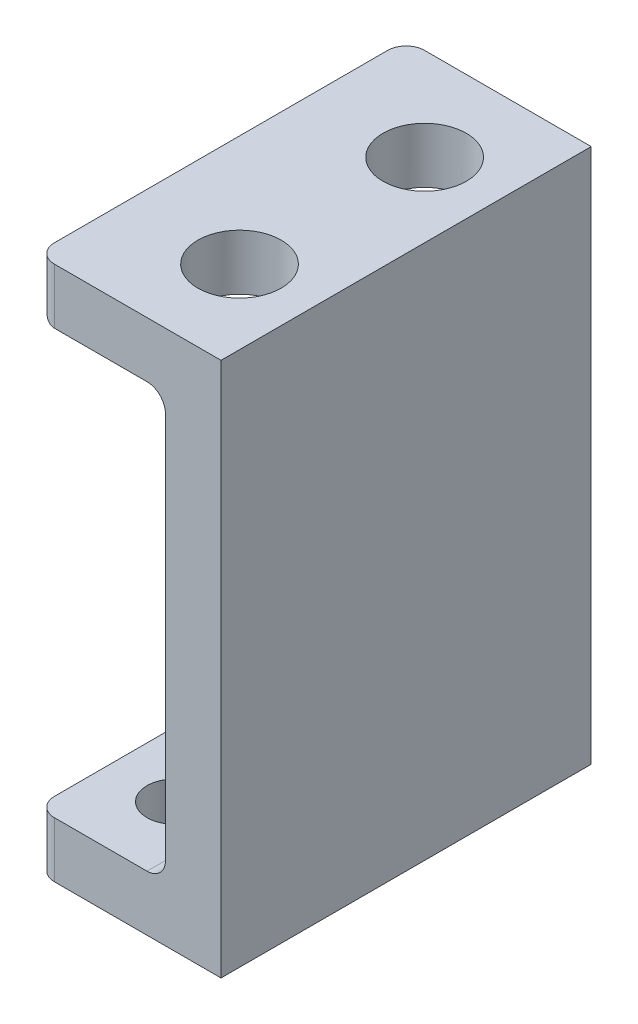
ISO-10303-21;
HEADER;
FILE_DESCRIPTION(('STEP AP214'),'2;1');
FILE_NAME('part.step','',(''),(''),'','','');
FILE_SCHEMA(('AUTOMOTIVE_DESIGN { 1 0 10303 214 1 1 1 1 }'));
ENDSEC;
DATA;
#1=APPLICATION_CONTEXT('core data for automotive mechanical design processes');
#2=APPLICATION_PROTOCOL_DEFINITION('international standard','automotive_design',2000,#1);
#3=PRODUCT_CONTEXT('',#1,'mechanical');
#4=PRODUCT('Part','Part','',(#3));
#5=PRODUCT_RELATED_PRODUCT_CATEGORY('part','',(#4));
#6=PRODUCT_DEFINITION_FORMATION('','',#4);
#7=PRODUCT_DEFINITION_CONTEXT('part definition',#1,'design');
#8=PRODUCT_DEFINITION('design','',#6,#7);
#9=PRODUCT_DEFINITION_SHAPE('','',#8);
#10=(LENGTH_UNIT() NAMED_UNIT(*) SI_UNIT(.MILLI.,.METRE.));
#11=(NAMED_UNIT(*) PLANE_ANGLE_UNIT() SI_UNIT($,.RADIAN.));
#12=(NAMED_UNIT(*) SI_UNIT($,.STERADIAN.) SOLID_ANGLE_UNIT());
#13=UNCERTAINTY_MEASURE_WITH_UNIT(LENGTH_MEASURE(1.E-05),#10,'distance_accuracy_value','');
#14=(GEOMETRIC_REPRESENTATION_CONTEXT(3) GLOBAL_UNCERTAINTY_ASSIGNED_CONTEXT((#13)) GLOBAL_UNIT_ASSIGNED_CONTEXT((#10,
#11,#12)) REPRESENTATION_CONTEXT('',''));
#15=CARTESIAN_POINT('',(0.,0.,0.));
#16=DIRECTION('',(0.,0.,1.));
#17=DIRECTION('',(1.,0.,0.));
#18=AXIS2_PLACEMENT_3D('',#15,#16,#17);
#19=CARTESIAN_POINT('',(-7.,-10.5818997294169,20.));
#20=DIRECTION('',(0.,-1.,0.));
#21=DIRECTION('',(0.,0.,-1.));
#22=AXIS2_PLACEMENT_3D('',#19,#20,#21);
#23=PLANE('',#22);
#24=CARTESIAN_POINT('',(-3.5,-10.5818997294169,4.));
#25=DIRECTION('',(0.,1.,0.));
#26=DIRECTION('',(0.,0.,1.));
#27=AXIS2_PLACEMENT_3D('',#24,#25,#26);
#28=CIRCLE('',#27,1.5);
#29=CARTESIAN_POINT('',(-3.5,-10.5818997294169,5.5));
#30=VERTEX_POINT('',#29);
#31=EDGE_CURVE('E277',#30,#30,#28,.T.);
#32=ORIENTED_EDGE('',*,*,#31,.F.);
#33=EDGE_LOOP('',(#32));
#34=FACE_BOUND('',#33,.T.);
#35=CARTESIAN_POINT('',(-3.5,-10.5818997294169,10.));
#36=DIRECTION('',(0.,1.,0.));
#37=DIRECTION('',(0.,0.,1.));
#38=AXIS2_PLACEMENT_3D('',#35,#36,#37);
#39=CIRCLE('',#38,1.5);
#40=CARTESIAN_POINT('',(-3.5,-10.5818997294169,11.5));
#41=VERTEX_POINT('',#40);
#42=EDGE_CURVE('E667',#41,#41,#39,.T.);
#43=ORIENTED_EDGE('',*,*,#42,.F.);
#44=EDGE_LOOP('',(#43));
#45=FACE_BOUND('',#44,.T.);
#46=CARTESIAN_POINT('',(-3.5,-10.5818997294169,16.));
#47=DIRECTION('',(0.,1.,0.));
#48=DIRECTION('',(0.,0.,1.));
#49=AXIS2_PLACEMENT_3D('',#46,#47,#48);
#50=CIRCLE('',#49,1.5);
#51=CARTESIAN_POINT('',(-3.5,-10.5818997294169,17.5));
#52=VERTEX_POINT('',#51);
#53=EDGE_CURVE('E331',#52,#52,#50,.T.);
#54=ORIENTED_EDGE('',*,*,#53,.F.);
#55=EDGE_LOOP('',(#54));
#56=FACE_BOUND('',#55,.T.);
#57=DIRECTION('',(-1.,0.,0.));
#58=VECTOR('',#57,1.);
#59=CARTESIAN_POINT('',(-7.,-10.5818997294169,20.));
#60=LINE('',#59,#58);
#61=CARTESIAN_POINT('',(-1.,-10.5818997294169,20.));
#62=VERTEX_POINT('',#61);
#63=CARTESIAN_POINT('',(-6.,-10.5818997294169,20.));
#64=VERTEX_POINT('',#63);
#65=EDGE_CURVE('E221',#62,#64,#60,.T.);
#66=ORIENTED_EDGE('',*,*,#65,.F.);
#67=DIRECTION('',(0.,0.,-1.));
#68=VECTOR('',#67,1.);
#69=CARTESIAN_POINT('',(-1.,-10.5818997294169,0.));
#70=LINE('',#69,#68);
#71=CARTESIAN_POINT('',(-1.,-10.5818997294169,0.));
#72=VERTEX_POINT('',#71);
#73=EDGE_CURVE('E305',#62,#72,#70,.T.);
#74=ORIENTED_EDGE('',*,*,#73,.T.);
#75=DIRECTION('',(-1.,0.,0.));
#76=VECTOR('',#75,1.);
#77=CARTESIAN_POINT('',(-7.,-10.5818997294169,0.));
#78=LINE('',#77,#76);
#79=CARTESIAN_POINT('',(-6.,-10.5818997294169,0.));
#80=VERTEX_POINT('',#79);
#81=EDGE_CURVE('E220',#72,#80,#78,.T.);
#82=ORIENTED_EDGE('',*,*,#81,.T.);
#83=CARTESIAN_POINT('',(-6.,-10.5818997294169,1.));
#84=DIRECTION('',(0.,-1.,0.));
#85=DIRECTION('',(0.,0.,-1.));
#86=AXIS2_PLACEMENT_3D('',#83,#84,#85);
#87=CIRCLE('',#86,1.);
#88=CARTESIAN_POINT('',(-7.,-10.5818997294169,1.));
#89=VERTEX_POINT('',#88);
#90=EDGE_CURVE('E303',#80,#89,#87,.F.);
#91=ORIENTED_EDGE('',*,*,#90,.T.);
#92=DIRECTION('',(0.,0.,-1.));
#93=VECTOR('',#92,1.);
#94=CARTESIAN_POINT('',(-7.,-10.5818997294169,20.));
#95=LINE('',#94,#93);
#96=CARTESIAN_POINT('',(-7.,-10.5818997294169,19.));
#97=VERTEX_POINT('',#96);
#98=EDGE_CURVE('E201',#97,#89,#95,.T.);
#99=ORIENTED_EDGE('',*,*,#98,.F.);
#100=CARTESIAN_POINT('',(-6.,-10.5818997294169,19.));
#101=DIRECTION('',(0.,-1.,0.));
#102=DIRECTION('',(0.,0.,-1.));
#103=AXIS2_PLACEMENT_3D('',#100,#101,#102);
#104=CIRCLE('',#103,1.);
#105=EDGE_CURVE('E301',#97,#64,#104,.F.);
#106=ORIENTED_EDGE('',*,*,#105,.T.);
#107=EDGE_LOOP('',(#66,#74,#82,#91,#99,#106));
#108=FACE_BOUND('',#107,.T.);
#109=ADVANCED_FACE('F43',(#34,#45,#56,#108),#23,.F.);
#110=CARTESIAN_POINT('',(-7.,-13.5818997294169,20.));
#111=DIRECTION('',(1.,0.,0.));
#112=DIRECTION('',(0.,0.,-1.));
#113=AXIS2_PLACEMENT_3D('',#110,#111,#112);
#114=PLANE('',#113);
#115=ORIENTED_EDGE('',*,*,#98,.T.);
#116=DIRECTION('',(0.,-1.,0.));
#117=VECTOR('',#116,1.);
#118=CARTESIAN_POINT('',(-7.,-13.5818997294169,1.));
#119=LINE('',#118,#117);
#120=CARTESIAN_POINT('',(-7.,-13.5818997294169,1.));
#121=VERTEX_POINT('',#120);
#122=EDGE_CURVE('E313',#89,#121,#119,.T.);
#123=ORIENTED_EDGE('',*,*,#122,.T.);
#124=DIRECTION('',(0.,0.,-1.));
#125=VECTOR('',#124,1.);
#126=CARTESIAN_POINT('',(-7.,-13.5818997294169,20.));
#127=LINE('',#126,#125);
#128=CARTESIAN_POINT('',(-7.,-13.5818997294169,19.));
#129=VERTEX_POINT('',#128);
#130=EDGE_CURVE('E259',#129,#121,#127,.T.);
#131=ORIENTED_EDGE('',*,*,#130,.F.);
#132=DIRECTION('',(0.,-1.,0.));
#133=VECTOR('',#132,1.);
#134=CARTESIAN_POINT('',(-7.,-10.5818997294169,19.));
#135=LINE('',#134,#133);
#136=EDGE_CURVE('E311',#129,#97,#135,.F.);
#137=ORIENTED_EDGE('',*,*,#136,.T.);
#138=EDGE_LOOP('',(#115,#123,#131,#137));
#139=FACE_BOUND('',#138,.T.);
#140=ADVANCED_FACE('F407',(#139),#114,.F.);
#141=CARTESIAN_POINT('',(3.,-13.5818997294169,20.));
#142=DIRECTION('',(0.,1.,0.));
#143=DIRECTION('',(-1.,0.,0.));
#144=AXIS2_PLACEMENT_3D('',#141,#142,#143);
#145=PLANE('',#144);
#146=CARTESIAN_POINT('',(-3.5,-13.5818997294169,4.));
#147=DIRECTION('',(0.,1.,0.));
#148=DIRECTION('',(-1.,0.,0.));
#149=AXIS2_PLACEMENT_3D('',#146,#147,#148);
#150=CIRCLE('',#149,1.5);
#151=CARTESIAN_POINT('',(-5.,-13.5818997294169,4.));
#152=VERTEX_POINT('',#151);
#153=EDGE_CURVE('E205',#152,#152,#150,.T.);
#154=ORIENTED_EDGE('',*,*,#153,.T.);
#155=EDGE_LOOP('',(#154));
#156=FACE_BOUND('',#155,.T.);
#157=CARTESIAN_POINT('',(-3.5,-13.5818997294169,10.));
#158=DIRECTION('',(0.,1.,0.));
#159=DIRECTION('',(-1.,0.,0.));
#160=AXIS2_PLACEMENT_3D('',#157,#158,#159);
#161=CIRCLE('',#160,1.5);
#162=CARTESIAN_POINT('',(-5.,-13.5818997294169,10.));
#163=VERTEX_POINT('',#162);
#164=EDGE_CURVE('E211',#163,#163,#161,.T.);
#165=ORIENTED_EDGE('',*,*,#164,.T.);
#166=EDGE_LOOP('',(#165));
#167=FACE_BOUND('',#166,.T.);
#168=CARTESIAN_POINT('',(-3.5,-13.5818997294169,16.));
#169=DIRECTION('',(0.,1.,0.));
#170=DIRECTION('',(-1.,0.,0.));
#171=AXIS2_PLACEMENT_3D('',#168,#169,#170);
#172=CIRCLE('',#171,1.5);
#173=CARTESIAN_POINT('',(-5.,-13.5818997294169,16.));
#174=VERTEX_POINT('',#173);
#175=EDGE_CURVE('E274',#174,#174,#172,.T.);
#176=ORIENTED_EDGE('',*,*,#175,.T.);
#177=EDGE_LOOP('',(#176));
#178=FACE_BOUND('',#177,.T.);
#179=ORIENTED_EDGE('',*,*,#130,.T.);
#180=CARTESIAN_POINT('',(-6.,-13.5818997294169,1.));
#181=DIRECTION('',(0.,1.,0.));
#182=DIRECTION('',(-1.,0.,0.));
#183=AXIS2_PLACEMENT_3D('',#180,#181,#182);
#184=CIRCLE('',#183,1.);
#185=CARTESIAN_POINT('',(-6.,-13.5818997294169,0.));
#186=VERTEX_POINT('',#185);
#187=EDGE_CURVE('E318',#121,#186,#184,.F.);
#188=ORIENTED_EDGE('',*,*,#187,.T.);
#189=DIRECTION('',(1.,0.,0.));
#190=VECTOR('',#189,1.);
#191=CARTESIAN_POINT('',(3.,-13.5818997294169,0.));
#192=LINE('',#191,#190);
#193=CARTESIAN_POINT('',(3.,-13.5818997294169,0.));
#194=VERTEX_POINT('',#193);
#195=EDGE_CURVE('E240',#186,#194,#192,.T.);
#196=ORIENTED_EDGE('',*,*,#195,.T.);
#197=DIRECTION('',(0.,0.,-1.));
#198=VECTOR('',#197,1.);
#199=CARTESIAN_POINT('',(3.,-13.5818997294169,20.));
#200=LINE('',#199,#198);
#201=CARTESIAN_POINT('',(3.,-13.5818997294169,20.));
#202=VERTEX_POINT('',#201);
#203=EDGE_CURVE('E256',#202,#194,#200,.T.);
#204=ORIENTED_EDGE('',*,*,#203,.F.);
#205=DIRECTION('',(1.,0.,0.));
#206=VECTOR('',#205,1.);
#207=CARTESIAN_POINT('',(3.,-13.5818997294169,20.));
#208=LINE('',#207,#206);
#209=CARTESIAN_POINT('',(-6.,-13.5818997294169,20.));
#210=VERTEX_POINT('',#209);
#211=EDGE_CURVE('E224',#210,#202,#208,.T.);
#212=ORIENTED_EDGE('',*,*,#211,.F.);
#213=CARTESIAN_POINT('',(-6.,-13.5818997294169,19.));
#214=DIRECTION('',(0.,1.,0.));
#215=DIRECTION('',(-1.,0.,0.));
#216=AXIS2_PLACEMENT_3D('',#213,#214,#215);
#217=CIRCLE('',#216,1.);
#218=EDGE_CURVE('E316',#210,#129,#217,.F.);
#219=ORIENTED_EDGE('',*,*,#218,.T.);
#220=EDGE_LOOP('',(#179,#188,#196,#204,#212,#219));
#221=FACE_BOUND('',#220,.T.);
#222=ADVANCED_FACE('F413',(#156,#167,#178,#221),#145,.F.);
#223=CARTESIAN_POINT('',(3.,15.3181002705831,20.));
#224=DIRECTION('',(-1.,0.,0.));
#225=DIRECTION('',(0.,-1.,0.));
#226=AXIS2_PLACEMENT_3D('',#223,#224,#225);
#227=PLANE('',#226);
#228=DIRECTION('',(0.,1.,0.));
#229=VECTOR('',#228,1.);
#230=CARTESIAN_POINT('',(3.,15.3181002705831,0.));
#231=LINE('',#230,#229);
#232=CARTESIAN_POINT('',(3.,15.3181002705831,0.));
#233=VERTEX_POINT('',#232);
#234=EDGE_CURVE('E242',#194,#233,#231,.T.);
#235=ORIENTED_EDGE('',*,*,#234,.T.);
#236=DIRECTION('',(0.,0.,-1.));
#237=VECTOR('',#236,1.);
#238=CARTESIAN_POINT('',(3.,15.3181002705831,20.));
#239=LINE('',#238,#237);
#240=CARTESIAN_POINT('',(3.,15.3181002705831,20.));
#241=VERTEX_POINT('',#240);
#242=EDGE_CURVE('E253',#241,#233,#239,.T.);
#243=ORIENTED_EDGE('',*,*,#242,.F.);
#244=DIRECTION('',(0.,1.,0.));
#245=VECTOR('',#244,1.);
#246=CARTESIAN_POINT('',(3.,15.3181002705831,20.));
#247=LINE('',#246,#245);
#248=EDGE_CURVE('E227',#202,#241,#247,.T.);
#249=ORIENTED_EDGE('',*,*,#248,.F.);
#250=ORIENTED_EDGE('',*,*,#203,.T.);
#251=EDGE_LOOP('',(#235,#243,#249,#250));
#252=FACE_BOUND('',#251,.T.);
#253=ADVANCED_FACE('F465',(#252),#227,.F.);
#254=CARTESIAN_POINT('',(-7.,15.3181002705831,20.));
#255=DIRECTION('',(0.,-1.,0.));
#256=DIRECTION('',(0.,0.,-1.));
#257=AXIS2_PLACEMENT_3D('',#254,#255,#256);
#258=PLANE('',#257);
#259=CARTESIAN_POINT('',(-1.,15.3181002705831,5.));
#260=DIRECTION('',(0.,1.,0.));
#261=DIRECTION('',(0.,0.,1.));
#262=AXIS2_PLACEMENT_3D('',#259,#260,#261);
#263=CIRCLE('',#262,2.25);
#264=CARTESIAN_POINT('',(-1.,15.3181002705831,7.25));
#265=VERTEX_POINT('',#264);
#266=EDGE_CURVE('E208',#265,#265,#263,.T.);
#267=ORIENTED_EDGE('',*,*,#266,.F.);
#268=EDGE_LOOP('',(#267));
#269=FACE_BOUND('',#268,.T.);
#270=CARTESIAN_POINT('',(-1.,15.3181002705831,15.));
#271=DIRECTION('',(0.,1.,0.));
#272=DIRECTION('',(0.,0.,1.));
#273=AXIS2_PLACEMENT_3D('',#270,#271,#272);
#274=CIRCLE('',#273,2.25);
#275=CARTESIAN_POINT('',(-1.,15.3181002705831,17.25));
#276=VERTEX_POINT('',#275);
#277=EDGE_CURVE('E204',#276,#276,#274,.T.);
#278=ORIENTED_EDGE('',*,*,#277,.F.);
#279=EDGE_LOOP('',(#278));
#280=FACE_BOUND('',#279,.T.);
#281=DIRECTION('',(-1.,0.,0.));
#282=VECTOR('',#281,1.);
#283=CARTESIAN_POINT('',(-7.,15.3181002705831,0.));
#284=LINE('',#283,#282);
#285=CARTESIAN_POINT('',(-6.,15.3181002705831,0.));
#286=VERTEX_POINT('',#285);
#287=EDGE_CURVE('E244',#233,#286,#284,.T.);
#288=ORIENTED_EDGE('',*,*,#287,.T.);
#289=CARTESIAN_POINT('',(-6.,15.3181002705831,1.));
#290=DIRECTION('',(0.,-1.,0.));
#291=DIRECTION('',(0.,0.,-1.));
#292=AXIS2_PLACEMENT_3D('',#289,#290,#291);
#293=CIRCLE('',#292,1.);
#294=CARTESIAN_POINT('',(-7.,15.3181002705831,1.));
#295=VERTEX_POINT('',#294);
#296=EDGE_CURVE('E292',#286,#295,#293,.F.);
#297=ORIENTED_EDGE('',*,*,#296,.T.);
#298=DIRECTION('',(0.,0.,-1.));
#299=VECTOR('',#298,1.);
#300=CARTESIAN_POINT('',(-7.,15.3181002705831,20.));
#301=LINE('',#300,#299);
#302=CARTESIAN_POINT('',(-7.,15.3181002705831,19.));
#303=VERTEX_POINT('',#302);
#304=EDGE_CURVE('E237',#303,#295,#301,.T.);
#305=ORIENTED_EDGE('',*,*,#304,.F.);
#306=CARTESIAN_POINT('',(-6.,15.3181002705831,19.));
#307=DIRECTION('',(0.,-1.,0.));
#308=DIRECTION('',(0.,0.,-1.));
#309=AXIS2_PLACEMENT_3D('',#306,#307,#308);
#310=CIRCLE('',#309,1.);
#311=CARTESIAN_POINT('',(-6.,15.3181002705831,20.));
#312=VERTEX_POINT('',#311);
#313=EDGE_CURVE('E290',#303,#312,#310,.F.);
#314=ORIENTED_EDGE('',*,*,#313,.T.);
#315=DIRECTION('',(-1.,0.,0.));
#316=VECTOR('',#315,1.);
#317=CARTESIAN_POINT('',(-7.,15.3181002705831,20.));
#318=LINE('',#317,#316);
#319=EDGE_CURVE('E229',#241,#312,#318,.T.);
#320=ORIENTED_EDGE('',*,*,#319,.F.);
#321=ORIENTED_EDGE('',*,*,#242,.T.);
#322=EDGE_LOOP('',(#288,#297,#305,#314,#320,#321));
#323=FACE_BOUND('',#322,.T.);
#324=ADVANCED_FACE('F483',(#269,#280,#323),#258,.F.);
#325=CARTESIAN_POINT('',(-7.,12.3181002705831,20.));
#326=DIRECTION('',(1.,0.,0.));
#327=DIRECTION('',(0.,0.,-1.));
#328=AXIS2_PLACEMENT_3D('',#325,#326,#327);
#329=PLANE('',#328);
#330=ORIENTED_EDGE('',*,*,#304,.T.);
#331=DIRECTION('',(0.,-1.,0.));
#332=VECTOR('',#331,1.);
#333=CARTESIAN_POINT('',(-7.,12.3181002705831,1.));
#334=LINE('',#333,#332);
#335=CARTESIAN_POINT('',(-7.,13.3181002705831,1.));
#336=VERTEX_POINT('',#335);
#337=EDGE_CURVE('E283',#295,#336,#334,.T.);
#338=ORIENTED_EDGE('',*,*,#337,.T.);
#339=DIRECTION('',(0.,0.,-1.));
#340=VECTOR('',#339,1.);
#341=CARTESIAN_POINT('',(-7.,13.3181002705831,20.));
#342=LINE('',#341,#340);
#343=CARTESIAN_POINT('',(-7.,13.3181002705831,19.));
#344=VERTEX_POINT('',#343);
#345=EDGE_CURVE('E273',#336,#344,#342,.F.);
#346=ORIENTED_EDGE('',*,*,#345,.T.);
#347=DIRECTION('',(0.,-1.,0.));
#348=VECTOR('',#347,1.);
#349=CARTESIAN_POINT('',(-7.,15.3181002705831,19.));
#350=LINE('',#349,#348);
#351=EDGE_CURVE('E281',#344,#303,#350,.F.);
#352=ORIENTED_EDGE('',*,*,#351,.T.);
#353=EDGE_LOOP('',(#330,#338,#346,#352));
#354=FACE_BOUND('',#353,.T.);
#355=ADVANCED_FACE('F485',(#354),#329,.F.);
#356=CARTESIAN_POINT('',(0.,12.3181002705831,20.));
#357=DIRECTION('',(0.,1.,0.));
#358=DIRECTION('',(0.,0.,1.));
#359=AXIS2_PLACEMENT_3D('',#356,#357,#358);
#360=PLANE('',#359);
#361=CARTESIAN_POINT('',(-1.,12.3181002705831,15.));
#362=DIRECTION('',(0.,1.,0.));
#363=DIRECTION('',(0.,0.,1.));
#364=AXIS2_PLACEMENT_3D('',#361,#362,#363);
#365=CIRCLE('',#364,2.25);
#366=CARTESIAN_POINT('',(-1.,12.3181002705831,12.75));
#367=VERTEX_POINT('',#366);
#368=CARTESIAN_POINT('',(-1.,12.3181002705831,17.25));
#369=VERTEX_POINT('',#368);
#370=EDGE_CURVE('E215',#367,#369,#365,.T.);
#371=ORIENTED_EDGE('',*,*,#370,.T.);
#372=DIRECTION('',(0.,0.,-1.));
#373=VECTOR('',#372,1.);
#374=CARTESIAN_POINT('',(-1.,12.3181002705831,20.));
#375=LINE('',#374,#373);
#376=CARTESIAN_POINT('',(-1.,12.3181002705831,20.));
#377=VERTEX_POINT('',#376);
#378=EDGE_CURVE('E341',#369,#377,#375,.F.);
#379=ORIENTED_EDGE('',*,*,#378,.T.);
#380=DIRECTION('',(1.,0.,0.));
#381=VECTOR('',#380,1.);
#382=CARTESIAN_POINT('',(0.,12.3181002705831,20.));
#383=LINE('',#382,#381);
#384=CARTESIAN_POINT('',(-6.,12.3181002705831,20.));
#385=VERTEX_POINT('',#384);
#386=EDGE_CURVE('E232',#385,#377,#383,.T.);
#387=ORIENTED_EDGE('',*,*,#386,.F.);
#388=DIRECTION('',(0.,0.,-1.));
#389=VECTOR('',#388,1.);
#390=CARTESIAN_POINT('',(-6.,12.3181002705831,20.));
#391=LINE('',#390,#389);
#392=CARTESIAN_POINT('',(-6.,12.3181002705831,0.));
#393=VERTEX_POINT('',#392);
#394=EDGE_CURVE('E299',#385,#393,#391,.T.);
#395=ORIENTED_EDGE('',*,*,#394,.T.);
#396=DIRECTION('',(1.,0.,0.));
#397=VECTOR('',#396,1.);
#398=CARTESIAN_POINT('',(0.,12.3181002705831,0.));
#399=LINE('',#398,#397);
#400=CARTESIAN_POINT('',(-1.,12.3181002705831,0.));
#401=VERTEX_POINT('',#400);
#402=EDGE_CURVE('E247',#393,#401,#399,.T.);
#403=ORIENTED_EDGE('',*,*,#402,.T.);
#404=DIRECTION('',(0.,0.,-1.));
#405=VECTOR('',#404,1.);
#406=CARTESIAN_POINT('',(-1.,12.3181002705831,2.98443556292536));
#407=LINE('',#406,#405);
#408=CARTESIAN_POINT('',(-1.,12.3181002705831,2.75));
#409=VERTEX_POINT('',#408);
#410=EDGE_CURVE('E339',#401,#409,#407,.F.);
#411=ORIENTED_EDGE('',*,*,#410,.T.);
#412=CARTESIAN_POINT('',(-1.,12.3181002705831,5.));
#413=DIRECTION('',(0.,1.,0.));
#414=DIRECTION('',(0.,0.,1.));
#415=AXIS2_PLACEMENT_3D('',#412,#413,#414);
#416=CIRCLE('',#415,2.25);
#417=CARTESIAN_POINT('',(-1.,12.3181002705831,7.25));
#418=VERTEX_POINT('',#417);
#419=EDGE_CURVE('E217',#409,#418,#416,.T.);
#420=ORIENTED_EDGE('',*,*,#419,.T.);
#421=DIRECTION('',(0.,0.,-1.));
#422=VECTOR('',#421,1.);
#423=CARTESIAN_POINT('',(-1.,12.3181002705831,12.9844355629254));
#424=LINE('',#423,#422);
#425=EDGE_CURVE('E71',#418,#367,#424,.F.);
#426=ORIENTED_EDGE('',*,*,#425,.T.);
#427=EDGE_LOOP('',(#371,#379,#387,#395,#403,#411,#420,#426));
#428=FACE_BOUND('',#427,.T.);
#429=ADVANCED_FACE('F477',(#428),#360,.F.);
#430=CARTESIAN_POINT('',(0.,-10.5818997294169,20.));
#431=DIRECTION('',(1.,0.,0.));
#432=DIRECTION('',(0.,1.,0.));
#433=AXIS2_PLACEMENT_3D('',#430,#431,#432);
#434=PLANE('',#433);
#435=DIRECTION('',(0.,-1.,0.));
#436=VECTOR('',#435,1.);
#437=CARTESIAN_POINT('',(0.,-10.5818997294169,20.));
#438=LINE('',#437,#436);
#439=CARTESIAN_POINT('',(0.,11.3181002705831,20.));
#440=VERTEX_POINT('',#439);
#441=CARTESIAN_POINT('',(0.,-9.58189972941692,20.));
#442=VERTEX_POINT('',#441);
#443=EDGE_CURVE('E235',#440,#442,#438,.T.);
#444=ORIENTED_EDGE('',*,*,#443,.F.);
#445=DIRECTION('',(0.,0.,-1.));
#446=VECTOR('',#445,1.);
#447=CARTESIAN_POINT('',(0.,11.3181002705831,17.0155644370746));
#448=LINE('',#447,#446);
#449=CARTESIAN_POINT('',(0.,11.3181002705831,17.0155644370746));
#450=VERTEX_POINT('',#449);
#451=EDGE_CURVE('E193',#440,#450,#448,.T.);
#452=ORIENTED_EDGE('',*,*,#451,.T.);
#453=DIRECTION('',(0.,1.,0.));
#454=VECTOR('',#453,1.);
#455=CARTESIAN_POINT('',(0.,-4.68189972941692,17.0155644370746));
#456=LINE('',#455,#454);
#457=CARTESIAN_POINT('',(0.,-4.68189972941692,17.0155644370746));
#458=VERTEX_POINT('',#457);
#459=EDGE_CURVE('E186',#450,#458,#456,.F.);
#460=ORIENTED_EDGE('',*,*,#459,.T.);
#461=DIRECTION('',(0.,0.,1.));
#462=VECTOR('',#461,1.);
#463=CARTESIAN_POINT('',(0.,-4.68189972941692,20.));
#464=LINE('',#463,#462);
#465=CARTESIAN_POINT('',(0.,-4.68189972941692,12.9844355629254));
#466=VERTEX_POINT('',#465);
#467=EDGE_CURVE('E191',#466,#458,#464,.T.);
#468=ORIENTED_EDGE('',*,*,#467,.F.);
#469=DIRECTION('',(0.,1.,0.));
#470=VECTOR('',#469,1.);
#471=CARTESIAN_POINT('',(0.,-4.68189972941692,12.9844355629254));
#472=LINE('',#471,#470);
#473=CARTESIAN_POINT('',(0.,11.3181002705831,12.9844355629254));
#474=VERTEX_POINT('',#473);
#475=EDGE_CURVE('E195',#466,#474,#472,.T.);
#476=ORIENTED_EDGE('',*,*,#475,.T.);
#477=DIRECTION('',(0.,0.,-1.));
#478=VECTOR('',#477,1.);
#479=CARTESIAN_POINT('',(0.,11.3181002705831,7.01556443707464));
#480=LINE('',#479,#478);
#481=CARTESIAN_POINT('',(0.,11.3181002705831,7.01556443707464));
#482=VERTEX_POINT('',#481);
#483=EDGE_CURVE('E325',#474,#482,#480,.T.);
#484=ORIENTED_EDGE('',*,*,#483,.T.);
#485=DIRECTION('',(0.,1.,0.));
#486=VECTOR('',#485,1.);
#487=CARTESIAN_POINT('',(0.,-4.68189972941692,7.01556443707464));
#488=LINE('',#487,#486);
#489=CARTESIAN_POINT('',(0.,-4.68189972941692,7.01556443707464));
#490=VERTEX_POINT('',#489);
#491=EDGE_CURVE('E268',#482,#490,#488,.F.);
#492=ORIENTED_EDGE('',*,*,#491,.T.);
#493=DIRECTION('',(0.,0.,1.));
#494=VECTOR('',#493,1.);
#495=CARTESIAN_POINT('',(0.,-4.68189972941692,20.));
#496=LINE('',#495,#494);
#497=CARTESIAN_POINT('',(0.,-4.68189972941692,2.98443556292536));
#498=VERTEX_POINT('',#497);
#499=EDGE_CURVE('E265',#498,#490,#496,.T.);
#500=ORIENTED_EDGE('',*,*,#499,.F.);
#501=DIRECTION('',(0.,1.,0.));
#502=VECTOR('',#501,1.);
#503=CARTESIAN_POINT('',(0.,-4.68189972941692,2.98443556292536));
#504=LINE('',#503,#502);
#505=CARTESIAN_POINT('',(0.,11.3181002705831,2.98443556292536));
#506=VERTEX_POINT('',#505);
#507=EDGE_CURVE('E270',#498,#506,#504,.T.);
#508=ORIENTED_EDGE('',*,*,#507,.T.);
#509=DIRECTION('',(0.,0.,-1.));
#510=VECTOR('',#509,1.);
#511=CARTESIAN_POINT('',(0.,11.3181002705831,0.));
#512=LINE('',#511,#510);
#513=CARTESIAN_POINT('',(0.,11.3181002705831,0.));
#514=VERTEX_POINT('',#513);
#515=EDGE_CURVE('E334',#506,#514,#512,.T.);
#516=ORIENTED_EDGE('',*,*,#515,.T.);
#517=DIRECTION('',(0.,-1.,0.));
#518=VECTOR('',#517,1.);
#519=CARTESIAN_POINT('',(0.,-10.5818997294169,0.));
#520=LINE('',#519,#518);
#521=CARTESIAN_POINT('',(0.,-9.58189972941692,0.));
#522=VERTEX_POINT('',#521);
#523=EDGE_CURVE('E225',#514,#522,#520,.T.);
#524=ORIENTED_EDGE('',*,*,#523,.T.);
#525=DIRECTION('',(0.,0.,-1.));
#526=VECTOR('',#525,1.);
#527=CARTESIAN_POINT('',(0.,-9.58189972941692,20.));
#528=LINE('',#527,#526);
#529=EDGE_CURVE('E308',#522,#442,#528,.F.);
#530=ORIENTED_EDGE('',*,*,#529,.T.);
#531=EDGE_LOOP('',(#444,#452,#460,#468,#476,#484,#492,#500,#508,#516,#524,#530));
#532=FACE_BOUND('',#531,.T.);
#533=ADVANCED_FACE('F189',(#532),#434,.F.);
#534=CARTESIAN_POINT('',(0.,0.,20.));
#535=DIRECTION('',(0.,0.,1.));
#536=DIRECTION('',(1.,0.,0.));
#537=AXIS2_PLACEMENT_3D('',#534,#535,#536);
#538=PLANE('',#537);
#539=ORIENTED_EDGE('',*,*,#319,.T.);
#540=DIRECTION('',(0.,-1.,0.));
#541=VECTOR('',#540,1.);
#542=CARTESIAN_POINT('',(-6.,12.3181002705831,20.));
#543=LINE('',#542,#541);
#544=EDGE_CURVE('E297',#312,#385,#543,.T.);
#545=ORIENTED_EDGE('',*,*,#544,.T.);
#546=ORIENTED_EDGE('',*,*,#386,.T.);
#547=CARTESIAN_POINT('',(-1.,11.3181002705831,20.));
#548=DIRECTION('',(0.,0.,1.));
#549=DIRECTION('',(1.,0.,0.));
#550=AXIS2_PLACEMENT_3D('',#547,#548,#549);
#551=CIRCLE('',#550,1.);
#552=EDGE_CURVE('E349',#377,#440,#551,.F.);
#553=ORIENTED_EDGE('',*,*,#552,.T.);
#554=ORIENTED_EDGE('',*,*,#443,.T.);
#555=CARTESIAN_POINT('',(-1.,-9.58189972941692,20.));
#556=DIRECTION('',(0.,0.,1.));
#557=DIRECTION('',(1.,0.,0.));
#558=AXIS2_PLACEMENT_3D('',#555,#556,#557);
#559=CIRCLE('',#558,1.);
#560=EDGE_CURVE('E323',#442,#62,#559,.F.);
#561=ORIENTED_EDGE('',*,*,#560,.T.);
#562=ORIENTED_EDGE('',*,*,#65,.T.);
#563=DIRECTION('',(0.,-1.,0.));
#564=VECTOR('',#563,1.);
#565=CARTESIAN_POINT('',(-6.,-13.5818997294169,20.));
#566=LINE('',#565,#564);
#567=EDGE_CURVE('E294',#64,#210,#566,.T.);
#568=ORIENTED_EDGE('',*,*,#567,.T.);
#569=ORIENTED_EDGE('',*,*,#211,.T.);
#570=ORIENTED_EDGE('',*,*,#248,.T.);
#571=EDGE_LOOP('',(#539,#545,#546,#553,#554,#561,#562,#568,#569,#570));
#572=FACE_BOUND('',#571,.T.);
#573=ADVANCED_FACE('F450',(#572),#538,.T.);
#574=CARTESIAN_POINT('',(0.,0.,0.));
#575=DIRECTION('',(0.,0.,1.));
#576=DIRECTION('',(1.,0.,0.));
#577=AXIS2_PLACEMENT_3D('',#574,#575,#576);
#578=PLANE('',#577);
#579=ORIENTED_EDGE('',*,*,#402,.F.);
#580=DIRECTION('',(0.,-1.,0.));
#581=VECTOR('',#580,1.);
#582=CARTESIAN_POINT('',(-6.,0.,0.));
#583=LINE('',#582,#581);
#584=EDGE_CURVE('E288',#393,#286,#583,.F.);
#585=ORIENTED_EDGE('',*,*,#584,.T.);
#586=ORIENTED_EDGE('',*,*,#287,.F.);
#587=ORIENTED_EDGE('',*,*,#234,.F.);
#588=ORIENTED_EDGE('',*,*,#195,.F.);
#589=DIRECTION('',(0.,-1.,0.));
#590=VECTOR('',#589,1.);
#591=CARTESIAN_POINT('',(-6.,0.,0.));
#592=LINE('',#591,#590);
#593=EDGE_CURVE('E286',#186,#80,#592,.F.);
#594=ORIENTED_EDGE('',*,*,#593,.T.);
#595=ORIENTED_EDGE('',*,*,#81,.F.);
#596=CARTESIAN_POINT('',(-1.,-9.58189972941692,0.));
#597=DIRECTION('',(0.,0.,1.));
#598=DIRECTION('',(1.,0.,0.));
#599=AXIS2_PLACEMENT_3D('',#596,#597,#598);
#600=CIRCLE('',#599,1.);
#601=EDGE_CURVE('E320',#72,#522,#600,.T.);
#602=ORIENTED_EDGE('',*,*,#601,.T.);
#603=ORIENTED_EDGE('',*,*,#523,.F.);
#604=CARTESIAN_POINT('',(-1.,11.3181002705831,0.));
#605=DIRECTION('',(0.,0.,1.));
#606=DIRECTION('',(1.,0.,0.));
#607=AXIS2_PLACEMENT_3D('',#604,#605,#606);
#608=CIRCLE('',#607,1.);
#609=EDGE_CURVE('E371',#514,#401,#608,.T.);
#610=ORIENTED_EDGE('',*,*,#609,.T.);
#611=EDGE_LOOP('',(#579,#585,#586,#587,#588,#594,#595,#602,#603,#610));
#612=FACE_BOUND('',#611,.T.);
#613=ADVANCED_FACE('F456',(#612),#578,.F.);
#614=CARTESIAN_POINT('',(-1.,-4.68189972941692,15.));
#615=DIRECTION('',(0.,1.,0.));
#616=DIRECTION('',(0.,0.,1.));
#617=AXIS2_PLACEMENT_3D('',#614,#615,#616);
#618=CYLINDRICAL_SURFACE('',#617,2.25);
#619=ORIENTED_EDGE('',*,*,#277,.T.);
#620=EDGE_LOOP('',(#619));
#621=FACE_BOUND('',#620,.T.);
#622=CARTESIAN_POINT('',(-1.,-4.68189972941692,15.));
#623=DIRECTION('',(0.,1.,0.));
#624=DIRECTION('',(0.,0.,1.));
#625=AXIS2_PLACEMENT_3D('',#622,#623,#624);
#626=CIRCLE('',#625,2.25);
#627=EDGE_CURVE('E199',#458,#466,#626,.T.);
#628=ORIENTED_EDGE('',*,*,#627,.F.);
#629=ORIENTED_EDGE('',*,*,#459,.F.);
#630=CARTESIAN_POINT('',(0.,11.3181002705831,17.0155644370746));
#631=CARTESIAN_POINT('',(1.48836316631487E-06,11.3447161556072,17.0155602325277));
#632=CARTESIAN_POINT('',(-0.0010632969182915,11.3713175810116,17.0160922970979));
#633=CARTESIAN_POINT('',(-0.00530018271245625,11.4242988466218,17.0181874934479));
#634=CARTESIAN_POINT('',(-0.00847128599793927,11.4506787857073,17.019750137302));
#635=CARTESIAN_POINT('',(-0.0210604197093475,11.5289410419798,17.0258994362558));
#636=CARTESIAN_POINT('',(-0.0335549444351816,11.5802489884328,17.0319484000429));
#637=CARTESIAN_POINT('',(-0.0662095344662857,11.6797343279239,17.0471575045015));
#638=CARTESIAN_POINT('',(-0.0863587387331733,11.7279160438098,17.0563132351005));
#639=CARTESIAN_POINT('',(-0.133680037676294,11.8202812334524,17.0766926975636));
#640=CARTESIAN_POINT('',(-0.160860870416295,11.8644596394778,17.0879189974641));
#641=CARTESIAN_POINT('',(-0.223501614574146,11.95060745203,17.1120476018677));
#642=CARTESIAN_POINT('',(-0.259379193090618,11.9922559359859,17.1250111445333));
#643=CARTESIAN_POINT('',(-0.33751822202728,12.0691825279551,17.1506529133417));
#644=CARTESIAN_POINT('',(-0.379781311940624,12.1044589948182,17.1633310652464));
#645=CARTESIAN_POINT('',(-0.472134044846782,12.1693951719063,17.1877500606396));
#646=CARTESIAN_POINT('',(-0.522513121958351,12.1986761324614,17.1994099945645));
#647=CARTESIAN_POINT('',(-0.628069056058846,12.2481843387103,17.2196950487626));
#648=CARTESIAN_POINT('',(-0.683239576519249,12.2684233307473,17.2283241032891));
#649=CARTESIAN_POINT('',(-0.782100776984197,12.2950466082037,17.2398250589045));
#650=CARTESIAN_POINT('',(-0.825097675695077,12.3036548171981,17.2436066191704));
#651=CARTESIAN_POINT('',(-0.912048916562715,12.3151975152409,17.2487099532102));
#652=CARTESIAN_POINT('',(-0.956004540902808,12.3181238666866,17.2500281989035));
#653=CARTESIAN_POINT('',(-1.,12.3181002705831,17.25));
#654=B_SPLINE_CURVE_WITH_KNOTS('',3,(#630,#631,#632,#633,#634,#635,#636,#637,#638,#639,#640,
#641,#642,#643,#644,#645,#646,#647,#648,#649,#650,#651,#652,#653),.UNSPECIFIED.,.F.,.F.,(4,2,2,
2,2,2,2,2,2,2,2,4),(0.,0.0797932639592799,0.159548777041719,0.318162906381669,0.476552817493902,
0.635140510047139,0.803849388584552,0.972601657313959,1.14997019662001,1.32710764316876,
1.45871926952588,1.59051925248954),.UNSPECIFIED.);
#655=EDGE_CURVE('E64',#450,#369,#654,.T.);
#656=ORIENTED_EDGE('',*,*,#655,.T.);
#657=ORIENTED_EDGE('',*,*,#370,.F.);
#658=CARTESIAN_POINT('',(-1.,12.3181002705831,12.75));
#659=CARTESIAN_POINT('',(-0.973252081997551,12.3181014120324,12.7499974932305));
#660=CARTESIAN_POINT('',(-0.946518119350799,12.3170263730803,12.7504775077362));
#661=CARTESIAN_POINT('',(-0.893263790824044,12.3127463798883,12.7523756006342));
#662=CARTESIAN_POINT('',(-0.866743354861127,12.3095421559479,12.7537933573848));
#663=CARTESIAN_POINT('',(-0.788009114088748,12.2968096371055,12.7593950930743));
#664=CARTESIAN_POINT('',(-0.736358976143837,12.284160977696,12.7649280771519));
#665=CARTESIAN_POINT('',(-0.636165797388521,12.2510590029999,12.7790339037765));
#666=CARTESIAN_POINT('',(-0.587620124541142,12.2306124042334,12.7876041298384));
#667=CARTESIAN_POINT('',(-0.494636580031635,12.1825932712578,12.8069733864174));
#668=CARTESIAN_POINT('',(-0.450202358628268,12.1550144857793,12.8177743704842));
#669=CARTESIAN_POINT('',(-0.364258692067117,12.0919325674314,12.8412001372404));
#670=CARTESIAN_POINT('',(-0.323008211436062,12.0561010170029,12.853889272193));
#671=CARTESIAN_POINT('',(-0.246871160090494,11.9782250513563,12.8794076691465));
#672=CARTESIAN_POINT('',(-0.211988258068348,11.9361770796254,12.892237007443));
#673=CARTESIAN_POINT('',(-0.147559062411491,11.8441060873337,12.9174265968998));
#674=CARTESIAN_POINT('',(-0.118442717035575,11.7937609526809,12.9297158402623));
#675=CARTESIAN_POINT('',(-0.0692362860572523,11.6883075635515,12.9513652975969));
#676=CARTESIAN_POINT('',(-0.0491311226258818,11.63320745094,12.9607303963242));
#677=CARTESIAN_POINT('',(-0.0227761665545459,11.5346840136323,12.9732552468092));
#678=CARTESIAN_POINT('',(-0.0142774710179543,11.4919779552749,12.9773975093163));
#679=CARTESIAN_POINT('',(-0.00287104784835293,11.4055654016931,12.9830109421908));
#680=CARTESIAN_POINT('',(2.47363351490676E-05,11.3618569698542,12.984476406188));
#681=CARTESIAN_POINT('',(0.,11.3181002705831,12.9844355629254));
#682=B_SPLINE_CURVE_WITH_KNOTS('',3,(#658,#659,#660,#661,#662,#663,#664,#665,#666,#667,#668,
#669,#670,#671,#672,#673,#674,#675,#676,#677,#678,#679,#680,#681),.UNSPECIFIED.,.F.,.F.,(4,2,2,
2,2,2,2,2,2,2,2,4),(0.,0.0801907567904887,0.160354022752437,0.319901104431925,0.47931107426444,
0.638861241232963,0.806424384867807,0.974083767690732,1.1515223425195,1.32866290221197,
1.4594514920562,1.59051857165217),.UNSPECIFIED.);
#683=EDGE_CURVE('E11',#367,#474,#682,.T.);
#684=ORIENTED_EDGE('',*,*,#683,.T.);
#685=ORIENTED_EDGE('',*,*,#475,.F.);
#686=EDGE_LOOP('',(#628,#629,#656,#657,#684,#685));
#687=FACE_BOUND('',#686,.T.);
#688=ADVANCED_FACE('F203',(#621,#687),#618,.F.);
#689=CARTESIAN_POINT('',(-1.,-4.68189972941692,15.));
#690=DIRECTION('',(0.,1.,0.));
#691=DIRECTION('',(0.,0.,1.));
#692=AXIS2_PLACEMENT_3D('',#689,#690,#691);
#693=PLANE('',#692);
#694=ORIENTED_EDGE('',*,*,#467,.T.);
#695=ORIENTED_EDGE('',*,*,#627,.T.);
#696=EDGE_LOOP('',(#694,#695));
#697=FACE_BOUND('',#696,.T.);
#698=ADVANCED_FACE('F198',(#697),#693,.T.);
#699=CARTESIAN_POINT('',(-1.,-4.68189972941692,5.));
#700=DIRECTION('',(0.,1.,0.));
#701=DIRECTION('',(0.,0.,1.));
#702=AXIS2_PLACEMENT_3D('',#699,#700,#701);
#703=CYLINDRICAL_SURFACE('',#702,2.25);
#704=ORIENTED_EDGE('',*,*,#266,.T.);
#705=EDGE_LOOP('',(#704));
#706=FACE_BOUND('',#705,.T.);
#707=CARTESIAN_POINT('',(-1.,-4.68189972941692,5.));
#708=DIRECTION('',(0.,1.,0.));
#709=DIRECTION('',(0.,0.,1.));
#710=AXIS2_PLACEMENT_3D('',#707,#708,#709);
#711=CIRCLE('',#710,2.25);
#712=EDGE_CURVE('E218',#490,#498,#711,.T.);
#713=ORIENTED_EDGE('',*,*,#712,.F.);
#714=ORIENTED_EDGE('',*,*,#491,.F.);
#715=CARTESIAN_POINT('',(0.,11.3181002705831,7.01556443707464));
#716=CARTESIAN_POINT('',(1.48836316627944E-06,11.3447161556072,7.0155602325277));
#717=CARTESIAN_POINT('',(-0.00106329691829155,11.3713175810116,7.01609229709787));
#718=CARTESIAN_POINT('',(-0.00530018271245633,11.4242988466218,7.01818749344794));
#719=CARTESIAN_POINT('',(-0.00847128599793935,11.4506787857073,7.01975013730202));
#720=CARTESIAN_POINT('',(-0.0210604197093476,11.5289410419798,7.02589943625585));
#721=CARTESIAN_POINT('',(-0.0335549444351817,11.5802489884328,7.03194840004289));
#722=CARTESIAN_POINT('',(-0.0662095344662857,11.6797343279239,7.04715750450154));
#723=CARTESIAN_POINT('',(-0.0863587387331732,11.7279160438098,7.05631323510054));
#724=CARTESIAN_POINT('',(-0.133680037676294,11.8202812334524,7.07669269756356));
#725=CARTESIAN_POINT('',(-0.160860870416295,11.8644596394778,7.08791899746414));
#726=CARTESIAN_POINT('',(-0.223501614574146,11.95060745203,7.1120476018677));
#727=CARTESIAN_POINT('',(-0.259379193090617,11.9922559359859,7.1250111445333));
#728=CARTESIAN_POINT('',(-0.33751822202728,12.0691825279551,7.15065291334165));
#729=CARTESIAN_POINT('',(-0.379781311940624,12.1044589948182,7.16333106524642));
#730=CARTESIAN_POINT('',(-0.472134044846782,12.1693951719063,7.18775006063958));
#731=CARTESIAN_POINT('',(-0.522513121958351,12.1986761324614,7.1994099945645));
#732=CARTESIAN_POINT('',(-0.628069056058846,12.2481843387103,7.2196950487626));
#733=CARTESIAN_POINT('',(-0.683239576519249,12.2684233307473,7.22832410328911));
#734=CARTESIAN_POINT('',(-0.782100776984197,12.2950466082037,7.23982505890455));
#735=CARTESIAN_POINT('',(-0.825097675695077,12.3036548171981,7.24360661917041));
#736=CARTESIAN_POINT('',(-0.912048916562715,12.3151975152409,7.24870995321015));
#737=CARTESIAN_POINT('',(-0.956004540902808,12.3181238666866,7.25002819890345));
#738=CARTESIAN_POINT('',(-1.,12.3181002705831,7.25));
#739=B_SPLINE_CURVE_WITH_KNOTS('',3,(#715,#716,#717,#718,#719,#720,#721,#722,#723,#724,#725,
#726,#727,#728,#729,#730,#731,#732,#733,#734,#735,#736,#737,#738),.UNSPECIFIED.,.F.,.F.,(4,2,2,
2,2,2,2,2,2,2,2,4),(0.,0.0797932639592799,0.159548777041718,0.318162906381669,0.476552817493903,
0.635140510047139,0.803849388584551,0.972601657313957,1.14997019662001,1.32710764316876,
1.45871926952588,1.59051925248954),.UNSPECIFIED.);
#740=EDGE_CURVE('E57',#482,#418,#739,.T.);
#741=ORIENTED_EDGE('',*,*,#740,.T.);
#742=ORIENTED_EDGE('',*,*,#419,.F.);
#743=CARTESIAN_POINT('',(-1.,12.3181002705831,2.75));
#744=CARTESIAN_POINT('',(-0.973252081997551,12.3181014120324,2.74999749323049));
#745=CARTESIAN_POINT('',(-0.946518119350799,12.3170263730803,2.75047750773623));
#746=CARTESIAN_POINT('',(-0.893263790824044,12.3127463798883,2.75237560063417));
#747=CARTESIAN_POINT('',(-0.866743354861127,12.3095421559479,2.75379335738483));
#748=CARTESIAN_POINT('',(-0.788009114088748,12.2968096371055,2.75939509307431));
#749=CARTESIAN_POINT('',(-0.736358976143837,12.284160977696,2.76492807715187));
#750=CARTESIAN_POINT('',(-0.636165797388521,12.2510590029999,2.77903390377646));
#751=CARTESIAN_POINT('',(-0.587620124541142,12.2306124042334,2.78760412983836));
#752=CARTESIAN_POINT('',(-0.494636580031635,12.1825932712578,2.80697338641741));
#753=CARTESIAN_POINT('',(-0.450202358628268,12.1550144857793,2.81777437048423));
#754=CARTESIAN_POINT('',(-0.364258692067117,12.0919325674314,2.84120013724043));
#755=CARTESIAN_POINT('',(-0.323008211436062,12.0561010170029,2.85388927219305));
#756=CARTESIAN_POINT('',(-0.246871160090494,11.9782250513563,2.87940766914654));
#757=CARTESIAN_POINT('',(-0.211988258068348,11.9361770796254,2.89223700744299));
#758=CARTESIAN_POINT('',(-0.147559062411491,11.8441060873337,2.91742659689983));
#759=CARTESIAN_POINT('',(-0.118442717035575,11.7937609526809,2.92971584026225));
#760=CARTESIAN_POINT('',(-0.0692362860572528,11.6883075635515,2.95136529759689));
#761=CARTESIAN_POINT('',(-0.0491311226258819,11.63320745094,2.96073039632418));
#762=CARTESIAN_POINT('',(-0.0227761665545461,11.5346840136323,2.97325524680916));
#763=CARTESIAN_POINT('',(-0.0142774710179546,11.4919779552749,2.97739750931628));
#764=CARTESIAN_POINT('',(-0.00287104784835297,11.4055654016931,2.98301094219081));
#765=CARTESIAN_POINT('',(2.47363351491614E-05,11.3618569698542,2.984476406188));
#766=CARTESIAN_POINT('',(0.,11.3181002705831,2.98443556292536));
#767=B_SPLINE_CURVE_WITH_KNOTS('',3,(#743,#744,#745,#746,#747,#748,#749,#750,#751,#752,#753,
#754,#755,#756,#757,#758,#759,#760,#761,#762,#763,#764,#765,#766),.UNSPECIFIED.,.F.,.F.,(4,2,2,
2,2,2,2,2,2,2,2,4),(0.,0.0801907567904888,0.160354022752438,0.319901104431925,0.479311074264439,
0.638861241232962,0.806424384867807,0.974083767690731,1.1515223425195,1.32866290221197,
1.45945149205619,1.59051857165217),.UNSPECIFIED.);
#768=EDGE_CURVE('E366',#409,#506,#767,.T.);
#769=ORIENTED_EDGE('',*,*,#768,.T.);
#770=ORIENTED_EDGE('',*,*,#507,.F.);
#771=EDGE_LOOP('',(#713,#714,#741,#742,#769,#770));
#772=FACE_BOUND('',#771,.T.);
#773=ADVANCED_FACE('F376',(#706,#772),#703,.F.);
#774=CARTESIAN_POINT('',(-1.,-4.68189972941692,5.));
#775=DIRECTION('',(0.,1.,0.));
#776=DIRECTION('',(0.,0.,1.));
#777=AXIS2_PLACEMENT_3D('',#774,#775,#776);
#778=PLANE('',#777);
#779=ORIENTED_EDGE('',*,*,#499,.T.);
#780=ORIENTED_EDGE('',*,*,#712,.T.);
#781=EDGE_LOOP('',(#779,#780));
#782=FACE_BOUND('',#781,.T.);
#783=ADVANCED_FACE('F380',(#782),#778,.T.);
#784=CARTESIAN_POINT('',(-3.5,-30.5818997294169,16.));
#785=DIRECTION('',(0.,1.,0.));
#786=DIRECTION('',(0.,0.,1.));
#787=AXIS2_PLACEMENT_3D('',#784,#785,#786);
#788=CYLINDRICAL_SURFACE('',#787,1.5);
#789=ORIENTED_EDGE('',*,*,#53,.T.);
#790=EDGE_LOOP('',(#789));
#791=FACE_BOUND('',#790,.T.);
#792=ORIENTED_EDGE('',*,*,#175,.F.);
#793=EDGE_LOOP('',(#792));
#794=FACE_BOUND('',#793,.T.);
#795=ADVANCED_FACE('F385',(#791,#794),#788,.F.);
#796=CARTESIAN_POINT('',(-3.5,-30.5818997294169,10.));
#797=DIRECTION('',(0.,1.,0.));
#798=DIRECTION('',(0.,0.,1.));
#799=AXIS2_PLACEMENT_3D('',#796,#797,#798);
#800=CYLINDRICAL_SURFACE('',#799,1.5);
#801=ORIENTED_EDGE('',*,*,#42,.T.);
#802=EDGE_LOOP('',(#801));
#803=FACE_BOUND('',#802,.T.);
#804=ORIENTED_EDGE('',*,*,#164,.F.);
#805=EDGE_LOOP('',(#804));
#806=FACE_BOUND('',#805,.T.);
#807=ADVANCED_FACE('F389',(#803,#806),#800,.F.);
#808=CARTESIAN_POINT('',(-3.5,-30.5818997294169,4.));
#809=DIRECTION('',(0.,1.,0.));
#810=DIRECTION('',(0.,0.,1.));
#811=AXIS2_PLACEMENT_3D('',#808,#809,#810);
#812=CYLINDRICAL_SURFACE('',#811,1.5);
#813=ORIENTED_EDGE('',*,*,#31,.T.);
#814=EDGE_LOOP('',(#813));
#815=FACE_BOUND('',#814,.T.);
#816=ORIENTED_EDGE('',*,*,#153,.F.);
#817=EDGE_LOOP('',(#816));
#818=FACE_BOUND('',#817,.T.);
#819=ADVANCED_FACE('F393',(#815,#818),#812,.F.);
#820=CARTESIAN_POINT('',(-6.,0.,19.));
#821=DIRECTION('',(0.,1.,0.));
#822=DIRECTION('',(0.,0.,1.));
#823=AXIS2_PLACEMENT_3D('',#820,#821,#822);
#824=CYLINDRICAL_SURFACE('',#823,1.);
#825=ORIENTED_EDGE('',*,*,#313,.F.);
#826=ORIENTED_EDGE('',*,*,#351,.F.);
#827=CARTESIAN_POINT('',(-6.,13.3181002705831,19.));
#828=DIRECTION('',(0.,-0.707106781186547,-0.707106781186547));
#829=DIRECTION('',(0.,0.707106781186547,-0.707106781186547));
#830=AXIS2_PLACEMENT_3D('',#827,#828,#829);
#831=ELLIPSE('',#830,1.41421356237309,1.);
#832=EDGE_CURVE('E328',#385,#344,#831,.T.);
#833=ORIENTED_EDGE('',*,*,#832,.F.);
#834=ORIENTED_EDGE('',*,*,#544,.F.);
#835=EDGE_LOOP('',(#825,#826,#833,#834));
#836=FACE_BOUND('',#835,.T.);
#837=ADVANCED_FACE('F396',(#836),#824,.T.);
#838=CARTESIAN_POINT('',(-6.,13.3181002705831,20.));
#839=DIRECTION('',(0.,0.,-1.));
#840=DIRECTION('',(-1.,0.,0.));
#841=AXIS2_PLACEMENT_3D('',#838,#839,#840);
#842=CYLINDRICAL_SURFACE('',#841,1.);
#843=ORIENTED_EDGE('',*,*,#832,.T.);
#844=ORIENTED_EDGE('',*,*,#345,.F.);
#845=CARTESIAN_POINT('',(-6.,13.3181002705831,1.));
#846=DIRECTION('',(0.,0.707106781186547,-0.707106781186547));
#847=DIRECTION('',(0.,-0.707106781186547,-0.707106781186547));
#848=AXIS2_PLACEMENT_3D('',#845,#846,#847);
#849=ELLIPSE('',#848,1.41421356237309,1.);
#850=EDGE_CURVE('E326',#393,#336,#849,.T.);
#851=ORIENTED_EDGE('',*,*,#850,.F.);
#852=ORIENTED_EDGE('',*,*,#394,.F.);
#853=EDGE_LOOP('',(#843,#844,#851,#852));
#854=FACE_BOUND('',#853,.T.);
#855=ADVANCED_FACE('F402',(#854),#842,.T.);
#856=CARTESIAN_POINT('',(-6.,12.3181002705831,1.));
#857=DIRECTION('',(0.,-1.,0.));
#858=DIRECTION('',(0.,0.,-1.));
#859=AXIS2_PLACEMENT_3D('',#856,#857,#858);
#860=CYLINDRICAL_SURFACE('',#859,1.);
#861=ORIENTED_EDGE('',*,*,#296,.F.);
#862=ORIENTED_EDGE('',*,*,#584,.F.);
#863=ORIENTED_EDGE('',*,*,#850,.T.);
#864=ORIENTED_EDGE('',*,*,#337,.F.);
#865=EDGE_LOOP('',(#861,#862,#863,#864));
#866=FACE_BOUND('',#865,.T.);
#867=ADVANCED_FACE('F420',(#866),#860,.T.);
#868=CARTESIAN_POINT('',(-1.,-9.58189972941692,20.));
#869=DIRECTION('',(0.,0.,1.));
#870=DIRECTION('',(1.,0.,0.));
#871=AXIS2_PLACEMENT_3D('',#868,#869,#870);
#872=CYLINDRICAL_SURFACE('',#871,1.);
#873=ORIENTED_EDGE('',*,*,#560,.F.);
#874=ORIENTED_EDGE('',*,*,#529,.F.);
#875=ORIENTED_EDGE('',*,*,#601,.F.);
#876=ORIENTED_EDGE('',*,*,#73,.F.);
#877=EDGE_LOOP('',(#873,#874,#875,#876));
#878=FACE_BOUND('',#877,.T.);
#879=ADVANCED_FACE('F423',(#878),#872,.F.);
#880=CARTESIAN_POINT('',(-6.,-13.5818997294169,1.));
#881=DIRECTION('',(0.,-1.,0.));
#882=DIRECTION('',(0.,0.,-1.));
#883=AXIS2_PLACEMENT_3D('',#880,#881,#882);
#884=CYLINDRICAL_SURFACE('',#883,1.);
#885=ORIENTED_EDGE('',*,*,#90,.F.);
#886=ORIENTED_EDGE('',*,*,#593,.F.);
#887=ORIENTED_EDGE('',*,*,#187,.F.);
#888=ORIENTED_EDGE('',*,*,#122,.F.);
#889=EDGE_LOOP('',(#885,#886,#887,#888));
#890=FACE_BOUND('',#889,.T.);
#891=ADVANCED_FACE('F429',(#890),#884,.T.);
#892=CARTESIAN_POINT('',(-6.,0.,19.));
#893=DIRECTION('',(0.,1.,0.));
#894=DIRECTION('',(0.,0.,1.));
#895=AXIS2_PLACEMENT_3D('',#892,#893,#894);
#896=CYLINDRICAL_SURFACE('',#895,1.);
#897=ORIENTED_EDGE('',*,*,#105,.F.);
#898=ORIENTED_EDGE('',*,*,#136,.F.);
#899=ORIENTED_EDGE('',*,*,#218,.F.);
#900=ORIENTED_EDGE('',*,*,#567,.F.);
#901=EDGE_LOOP('',(#897,#898,#899,#900));
#902=FACE_BOUND('',#901,.T.);
#903=ADVANCED_FACE('F359',(#902),#896,.T.);
#904=CARTESIAN_POINT('',(-1.,11.3181002705831,20.));
#905=DIRECTION('',(0.,0.,1.));
#906=DIRECTION('',(1.,0.,0.));
#907=AXIS2_PLACEMENT_3D('',#904,#905,#906);
#908=CYLINDRICAL_SURFACE('',#907,1.);
#909=ORIENTED_EDGE('',*,*,#552,.F.);
#910=ORIENTED_EDGE('',*,*,#378,.F.);
#911=ORIENTED_EDGE('',*,*,#655,.F.);
#912=ORIENTED_EDGE('',*,*,#451,.F.);
#913=EDGE_LOOP('',(#909,#910,#911,#912));
#914=FACE_BOUND('',#913,.T.);
#915=ADVANCED_FACE('F354',(#914),#908,.F.);
#916=CARTESIAN_POINT('',(-1.,11.3181002705831,20.));
#917=DIRECTION('',(0.,0.,1.));
#918=DIRECTION('',(1.,0.,0.));
#919=AXIS2_PLACEMENT_3D('',#916,#917,#918);
#920=CYLINDRICAL_SURFACE('',#919,1.);
#921=ORIENTED_EDGE('',*,*,#768,.F.);
#922=ORIENTED_EDGE('',*,*,#410,.F.);
#923=ORIENTED_EDGE('',*,*,#609,.F.);
#924=ORIENTED_EDGE('',*,*,#515,.F.);
#925=EDGE_LOOP('',(#921,#922,#923,#924));
#926=FACE_BOUND('',#925,.T.);
#927=ADVANCED_FACE('F358',(#926),#920,.F.);
#928=CARTESIAN_POINT('',(-1.,11.3181002705831,20.));
#929=DIRECTION('',(0.,0.,1.));
#930=DIRECTION('',(1.,0.,0.));
#931=AXIS2_PLACEMENT_3D('',#928,#929,#930);
#932=CYLINDRICAL_SURFACE('',#931,1.);
#933=ORIENTED_EDGE('',*,*,#683,.F.);
#934=ORIENTED_EDGE('',*,*,#425,.F.);
#935=ORIENTED_EDGE('',*,*,#740,.F.);
#936=ORIENTED_EDGE('',*,*,#483,.F.);
#937=EDGE_LOOP('',(#933,#934,#935,#936));
#938=FACE_BOUND('',#937,.T.);
#939=ADVANCED_FACE('F45',(#938),#932,.F.);
#940=CLOSED_SHELL('',(#109,#140,#222,#253,#324,#355,#429,#533,#573,#613,#688,#698,#773,#783,
#795,#807,#819,#837,#855,#867,#879,#891,#903,#915,#927,#939));
#941=MANIFOLD_SOLID_BREP('B2',#940);
#942=ADVANCED_BREP_SHAPE_REPRESENTATION('',(#18,#941),#14);
#943=SHAPE_DEFINITION_REPRESENTATION(#9,#942);
ENDSEC;
END-ISO-10303-21;
